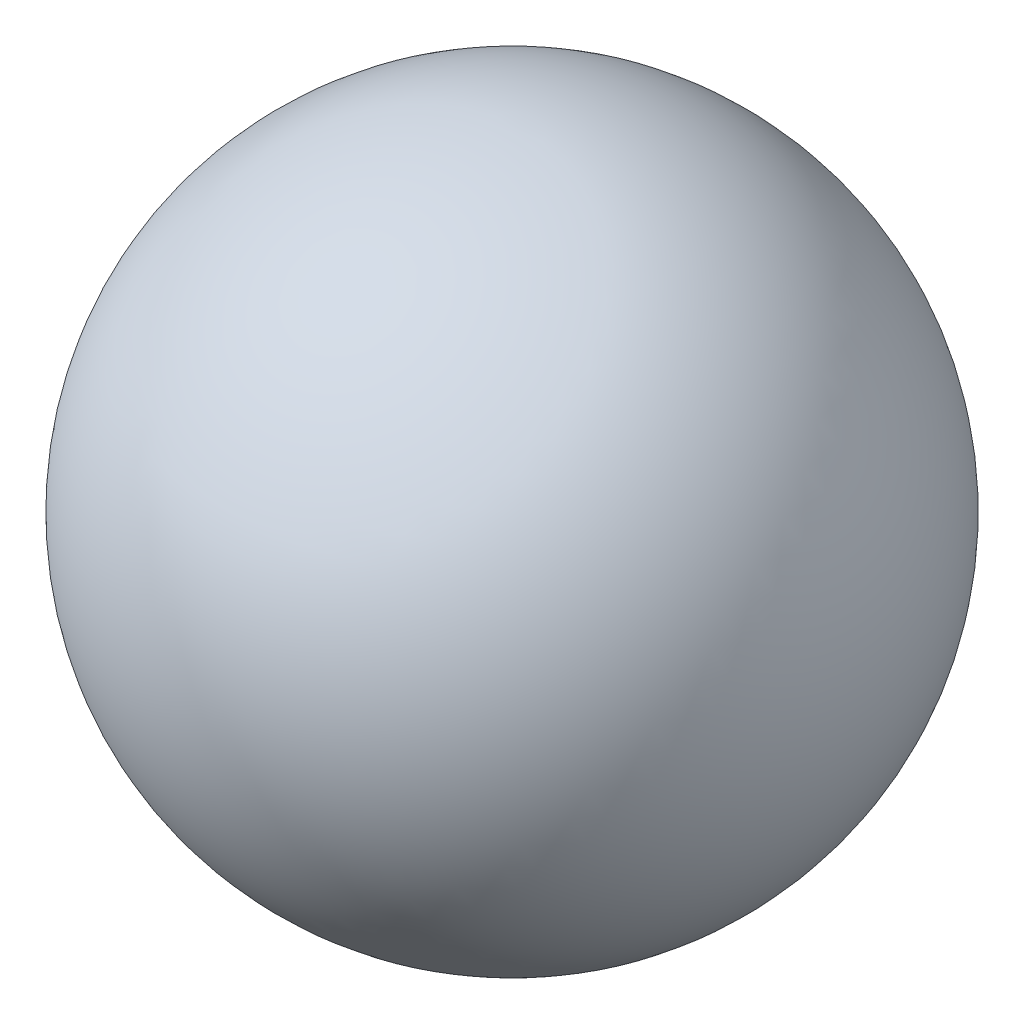
ISO-10303-21;
HEADER;
FILE_DESCRIPTION(('STEP AP214'),'2;1');
FILE_NAME('part.step','',(''),(''),'','','');
FILE_SCHEMA(('AUTOMOTIVE_DESIGN { 1 0 10303 214 1 1 1 1 }'));
ENDSEC;
DATA;
#1=APPLICATION_CONTEXT('core data for automotive mechanical design processes');
#2=APPLICATION_PROTOCOL_DEFINITION('international standard','automotive_design',2000,#1);
#3=PRODUCT_CONTEXT('',#1,'mechanical');
#4=PRODUCT('Part','Part','',(#3));
#5=PRODUCT_RELATED_PRODUCT_CATEGORY('part','',(#4));
#6=PRODUCT_DEFINITION_FORMATION('','',#4);
#7=PRODUCT_DEFINITION_CONTEXT('part definition',#1,'design');
#8=PRODUCT_DEFINITION('design','',#6,#7);
#9=PRODUCT_DEFINITION_SHAPE('','',#8);
#10=(LENGTH_UNIT() NAMED_UNIT(*) SI_UNIT(.MILLI.,.METRE.));
#11=(NAMED_UNIT(*) PLANE_ANGLE_UNIT() SI_UNIT($,.RADIAN.));
#12=(NAMED_UNIT(*) SI_UNIT($,.STERADIAN.) SOLID_ANGLE_UNIT());
#13=UNCERTAINTY_MEASURE_WITH_UNIT(LENGTH_MEASURE(1.E-05),#10,'distance_accuracy_value','');
#14=(GEOMETRIC_REPRESENTATION_CONTEXT(3) GLOBAL_UNCERTAINTY_ASSIGNED_CONTEXT((#13)) GLOBAL_UNIT_ASSIGNED_CONTEXT((#10,
#11,#12)) REPRESENTATION_CONTEXT('',''));
#15=CARTESIAN_POINT('',(0.,0.,0.));
#16=DIRECTION('',(0.,0.,1.));
#17=DIRECTION('',(1.,0.,0.));
#18=AXIS2_PLACEMENT_3D('',#15,#16,#17);
#19=CARTESIAN_POINT('',(0.,0.,0.));
#20=DIRECTION('',(0.,1.,0.));
#21=DIRECTION('',(-1.,0.,0.));
#22=AXIS2_PLACEMENT_3D('',#19,#20,#21);
#23=SPHERICAL_SURFACE('',#22,1.19);
#24=CARTESIAN_POINT('',(0.,1.19,0.));
#25=VERTEX_POINT('',#24);
#26=VERTEX_LOOP('',#25);
#27=FACE_BOUND('',#26,.T.);
#28=ADVANCED_FACE('F37',(#27),#23,.T.);
#29=CLOSED_SHELL('',(#28));
#30=MANIFOLD_SOLID_BREP('B2',#29);
#31=ADVANCED_BREP_SHAPE_REPRESENTATION('',(#18,#30),#14);
#32=SHAPE_DEFINITION_REPRESENTATION(#9,#31);
ENDSEC;
END-ISO-10303-21;
